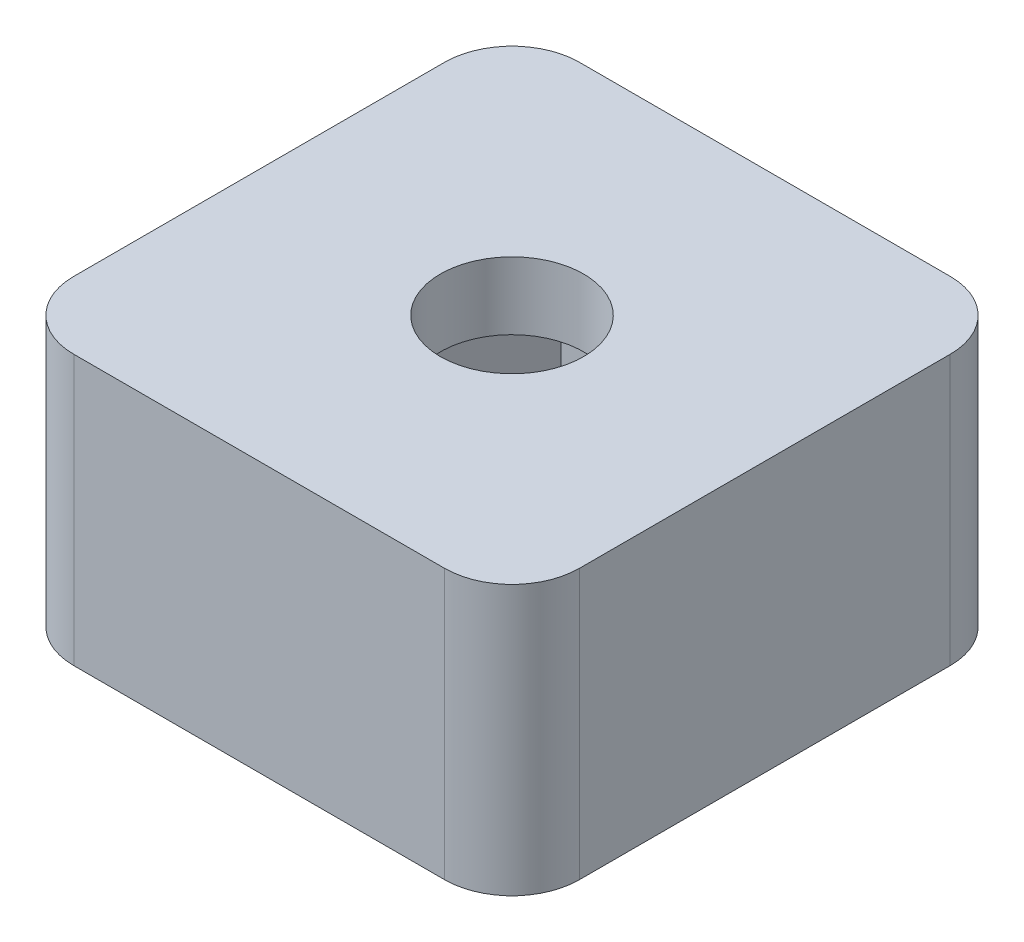
ISO-10303-21;
HEADER;
FILE_DESCRIPTION(('STEP AP214'),'2;1');
FILE_NAME('part.step','',(''),(''),'','','');
FILE_SCHEMA(('AUTOMOTIVE_DESIGN { 1 0 10303 214 1 1 1 1 }'));
ENDSEC;
DATA;
#1=APPLICATION_CONTEXT('core data for automotive mechanical design processes');
#2=APPLICATION_PROTOCOL_DEFINITION('international standard','automotive_design',2000,#1);
#3=PRODUCT_CONTEXT('',#1,'mechanical');
#4=PRODUCT('Part','Part','',(#3));
#5=PRODUCT_RELATED_PRODUCT_CATEGORY('part','',(#4));
#6=PRODUCT_DEFINITION_FORMATION('','',#4);
#7=PRODUCT_DEFINITION_CONTEXT('part definition',#1,'design');
#8=PRODUCT_DEFINITION('design','',#6,#7);
#9=PRODUCT_DEFINITION_SHAPE('','',#8);
#10=(LENGTH_UNIT() NAMED_UNIT(*) SI_UNIT(.MILLI.,.METRE.));
#11=(NAMED_UNIT(*) PLANE_ANGLE_UNIT() SI_UNIT($,.RADIAN.));
#12=(NAMED_UNIT(*) SI_UNIT($,.STERADIAN.) SOLID_ANGLE_UNIT());
#13=UNCERTAINTY_MEASURE_WITH_UNIT(LENGTH_MEASURE(1.E-05),#10,'distance_accuracy_value','');
#14=(GEOMETRIC_REPRESENTATION_CONTEXT(3) GLOBAL_UNCERTAINTY_ASSIGNED_CONTEXT((#13)) GLOBAL_UNIT_ASSIGNED_CONTEXT((#10,
#11,#12)) REPRESENTATION_CONTEXT('',''));
#15=CARTESIAN_POINT('',(0.,0.,0.));
#16=DIRECTION('',(0.,0.,1.));
#17=DIRECTION('',(1.,0.,0.));
#18=AXIS2_PLACEMENT_3D('',#15,#16,#17);
#19=CARTESIAN_POINT('',(0.,0.,0.));
#20=DIRECTION('',(0.,-1.,0.));
#21=DIRECTION('',(0.,0.,-1.));
#22=AXIS2_PLACEMENT_3D('',#19,#20,#21);
#23=PLANE('',#22);
#24=DIRECTION('',(-1.,0.,0.));
#25=VECTOR('',#24,1.);
#26=CARTESIAN_POINT('',(0.,0.,-15.));
#27=LINE('',#26,#25);
#28=CARTESIAN_POINT('',(13.,0.,-15.));
#29=VERTEX_POINT('',#28);
#30=CARTESIAN_POINT('',(2.,0.,-15.));
#31=VERTEX_POINT('',#30);
#32=EDGE_CURVE('E176',#29,#31,#27,.T.);
#33=ORIENTED_EDGE('',*,*,#32,.F.);
#34=CARTESIAN_POINT('',(13.,0.,-13.));
#35=DIRECTION('',(0.,-1.,0.));
#36=DIRECTION('',(0.,0.,-1.));
#37=AXIS2_PLACEMENT_3D('',#34,#35,#36);
#38=CIRCLE('',#37,2.);
#39=CARTESIAN_POINT('',(15.,0.,-13.));
#40=VERTEX_POINT('',#39);
#41=EDGE_CURVE('E204',#29,#40,#38,.T.);
#42=ORIENTED_EDGE('',*,*,#41,.T.);
#43=DIRECTION('',(0.,0.,-1.));
#44=VECTOR('',#43,1.);
#45=CARTESIAN_POINT('',(15.,0.,0.));
#46=LINE('',#45,#44);
#47=CARTESIAN_POINT('',(15.,0.,-2.));
#48=VERTEX_POINT('',#47);
#49=EDGE_CURVE('E189',#48,#40,#46,.T.);
#50=ORIENTED_EDGE('',*,*,#49,.F.);
#51=CARTESIAN_POINT('',(13.,0.,-2.));
#52=DIRECTION('',(0.,-1.,0.));
#53=DIRECTION('',(0.,0.,-1.));
#54=AXIS2_PLACEMENT_3D('',#51,#52,#53);
#55=CIRCLE('',#54,2.);
#56=CARTESIAN_POINT('',(13.,0.,0.));
#57=VERTEX_POINT('',#56);
#58=EDGE_CURVE('E202',#48,#57,#55,.T.);
#59=ORIENTED_EDGE('',*,*,#58,.T.);
#60=DIRECTION('',(1.,0.,0.));
#61=VECTOR('',#60,1.);
#62=CARTESIAN_POINT('',(0.,0.,0.));
#63=LINE('',#62,#61);
#64=CARTESIAN_POINT('',(2.,0.,0.));
#65=VERTEX_POINT('',#64);
#66=EDGE_CURVE('E187',#65,#57,#63,.T.);
#67=ORIENTED_EDGE('',*,*,#66,.F.);
#68=CARTESIAN_POINT('',(2.,0.,-2.));
#69=DIRECTION('',(0.,-1.,0.));
#70=DIRECTION('',(0.,0.,-1.));
#71=AXIS2_PLACEMENT_3D('',#68,#69,#70);
#72=CIRCLE('',#71,2.);
#73=CARTESIAN_POINT('',(0.,0.,-2.));
#74=VERTEX_POINT('',#73);
#75=EDGE_CURVE('E200',#65,#74,#72,.T.);
#76=ORIENTED_EDGE('',*,*,#75,.T.);
#77=DIRECTION('',(0.,0.,1.));
#78=VECTOR('',#77,1.);
#79=CARTESIAN_POINT('',(0.,0.,0.));
#80=LINE('',#79,#78);
#81=CARTESIAN_POINT('',(0.,0.,-13.));
#82=VERTEX_POINT('',#81);
#83=EDGE_CURVE('E172',#82,#74,#80,.T.);
#84=ORIENTED_EDGE('',*,*,#83,.F.);
#85=CARTESIAN_POINT('',(2.,0.,-13.));
#86=DIRECTION('',(0.,-1.,0.));
#87=DIRECTION('',(0.,0.,-1.));
#88=AXIS2_PLACEMENT_3D('',#85,#86,#87);
#89=CIRCLE('',#88,2.);
#90=EDGE_CURVE('E198',#82,#31,#89,.T.);
#91=ORIENTED_EDGE('',*,*,#90,.T.);
#92=EDGE_LOOP('',(#33,#42,#50,#59,#67,#76,#84,#91));
#93=FACE_BOUND('',#92,.T.);
#94=DIRECTION('',(1.,0.,0.));
#95=VECTOR('',#94,1.);
#96=CARTESIAN_POINT('',(5.50814157129579,0.,-4.05));
#97=LINE('',#96,#95);
#98=CARTESIAN_POINT('',(5.50814157129579,0.,-4.05));
#99=VERTEX_POINT('',#98);
#100=CARTESIAN_POINT('',(9.49185842870421,0.,-4.05));
#101=VERTEX_POINT('',#100);
#102=EDGE_CURVE('E155',#99,#101,#97,.T.);
#103=ORIENTED_EDGE('',*,*,#102,.T.);
#104=DIRECTION('',(0.5,0.,-0.866025403784439));
#105=VECTOR('',#104,1.);
#106=CARTESIAN_POINT('',(9.49185842870421,0.,-4.05));
#107=LINE('',#106,#105);
#108=CARTESIAN_POINT('',(11.4837168574084,0.,-7.5));
#109=VERTEX_POINT('',#108);
#110=EDGE_CURVE('E421',#101,#109,#107,.T.);
#111=ORIENTED_EDGE('',*,*,#110,.T.);
#112=DIRECTION('',(-0.5,0.,-0.866025403784439));
#113=VECTOR('',#112,1.);
#114=CARTESIAN_POINT('',(11.4837168574084,0.,-7.5));
#115=LINE('',#114,#113);
#116=CARTESIAN_POINT('',(9.49185842870421,0.,-10.95));
#117=VERTEX_POINT('',#116);
#118=EDGE_CURVE('E159',#109,#117,#115,.T.);
#119=ORIENTED_EDGE('',*,*,#118,.T.);
#120=DIRECTION('',(-1.,0.,0.));
#121=VECTOR('',#120,1.);
#122=CARTESIAN_POINT('',(9.49185842870421,0.,-10.95));
#123=LINE('',#122,#121);
#124=CARTESIAN_POINT('',(5.50814157129579,0.,-10.95));
#125=VERTEX_POINT('',#124);
#126=EDGE_CURVE('E414',#117,#125,#123,.T.);
#127=ORIENTED_EDGE('',*,*,#126,.T.);
#128=DIRECTION('',(-0.5,0.,0.866025403784439));
#129=VECTOR('',#128,1.);
#130=CARTESIAN_POINT('',(5.50814157129579,0.,-10.95));
#131=LINE('',#130,#129);
#132=CARTESIAN_POINT('',(3.51628314259158,0.,-7.5));
#133=VERTEX_POINT('',#132);
#134=EDGE_CURVE('E418',#125,#133,#131,.T.);
#135=ORIENTED_EDGE('',*,*,#134,.T.);
#136=DIRECTION('',(0.5,0.,0.866025403784439));
#137=VECTOR('',#136,1.);
#138=CARTESIAN_POINT('',(3.51628314259158,0.,-7.5));
#139=LINE('',#138,#137);
#140=EDGE_CURVE('E427',#133,#99,#139,.T.);
#141=ORIENTED_EDGE('',*,*,#140,.T.);
#142=EDGE_LOOP('',(#103,#111,#119,#127,#135,#141));
#143=FACE_BOUND('',#142,.T.);
#144=ADVANCED_FACE('F33',(#93,#143),#23,.T.);
#145=CARTESIAN_POINT('',(0.,8.,0.));
#146=DIRECTION('',(1.,0.,0.));
#147=DIRECTION('',(0.,0.,-1.));
#148=AXIS2_PLACEMENT_3D('',#145,#146,#147);
#149=PLANE('',#148);
#150=ORIENTED_EDGE('',*,*,#83,.T.);
#151=DIRECTION('',(0.,-1.,0.));
#152=VECTOR('',#151,1.);
#153=CARTESIAN_POINT('',(0.,8.,-2.));
#154=LINE('',#153,#152);
#155=CARTESIAN_POINT('',(0.,8.,-2.));
#156=VERTEX_POINT('',#155);
#157=EDGE_CURVE('E11',#74,#156,#154,.F.);
#158=ORIENTED_EDGE('',*,*,#157,.T.);
#159=DIRECTION('',(0.,0.,1.));
#160=VECTOR('',#159,1.);
#161=CARTESIAN_POINT('',(0.,8.,0.));
#162=LINE('',#161,#160);
#163=CARTESIAN_POINT('',(0.,8.,-13.));
#164=VERTEX_POINT('',#163);
#165=EDGE_CURVE('E173',#164,#156,#162,.T.);
#166=ORIENTED_EDGE('',*,*,#165,.F.);
#167=DIRECTION('',(0.,-1.,0.));
#168=VECTOR('',#167,1.);
#169=CARTESIAN_POINT('',(0.,8.,-13.));
#170=LINE('',#169,#168);
#171=EDGE_CURVE('E41',#164,#82,#170,.T.);
#172=ORIENTED_EDGE('',*,*,#171,.T.);
#173=EDGE_LOOP('',(#150,#158,#166,#172));
#174=FACE_BOUND('',#173,.T.);
#175=ADVANCED_FACE('F226',(#174),#149,.F.);
#176=CARTESIAN_POINT('',(0.,8.,0.));
#177=DIRECTION('',(0.,0.,-1.));
#178=DIRECTION('',(-1.,0.,0.));
#179=AXIS2_PLACEMENT_3D('',#176,#177,#178);
#180=PLANE('',#179);
#181=ORIENTED_EDGE('',*,*,#66,.T.);
#182=DIRECTION('',(0.,-1.,0.));
#183=VECTOR('',#182,1.);
#184=CARTESIAN_POINT('',(13.,8.,0.));
#185=LINE('',#184,#183);
#186=CARTESIAN_POINT('',(13.,8.,0.));
#187=VERTEX_POINT('',#186);
#188=EDGE_CURVE('E48',#57,#187,#185,.F.);
#189=ORIENTED_EDGE('',*,*,#188,.T.);
#190=DIRECTION('',(1.,0.,0.));
#191=VECTOR('',#190,1.);
#192=CARTESIAN_POINT('',(0.,8.,0.));
#193=LINE('',#192,#191);
#194=CARTESIAN_POINT('',(2.,8.,0.));
#195=VERTEX_POINT('',#194);
#196=EDGE_CURVE('E175',#195,#187,#193,.T.);
#197=ORIENTED_EDGE('',*,*,#196,.F.);
#198=DIRECTION('',(0.,-1.,0.));
#199=VECTOR('',#198,1.);
#200=CARTESIAN_POINT('',(2.,8.,0.));
#201=LINE('',#200,#199);
#202=EDGE_CURVE('E218',#195,#65,#201,.T.);
#203=ORIENTED_EDGE('',*,*,#202,.T.);
#204=EDGE_LOOP('',(#181,#189,#197,#203));
#205=FACE_BOUND('',#204,.T.);
#206=ADVANCED_FACE('F237',(#205),#180,.F.);
#207=CARTESIAN_POINT('',(15.,8.,0.));
#208=DIRECTION('',(-1.,0.,0.));
#209=DIRECTION('',(0.,0.,1.));
#210=AXIS2_PLACEMENT_3D('',#207,#208,#209);
#211=PLANE('',#210);
#212=ORIENTED_EDGE('',*,*,#49,.T.);
#213=DIRECTION('',(0.,-1.,0.));
#214=VECTOR('',#213,1.);
#215=CARTESIAN_POINT('',(15.,8.,-13.));
#216=LINE('',#215,#214);
#217=CARTESIAN_POINT('',(15.,8.,-13.));
#218=VERTEX_POINT('',#217);
#219=EDGE_CURVE('E209',#40,#218,#216,.F.);
#220=ORIENTED_EDGE('',*,*,#219,.T.);
#221=DIRECTION('',(0.,0.,-1.));
#222=VECTOR('',#221,1.);
#223=CARTESIAN_POINT('',(15.,8.,0.));
#224=LINE('',#223,#222);
#225=CARTESIAN_POINT('',(15.,8.,-2.));
#226=VERTEX_POINT('',#225);
#227=EDGE_CURVE('E178',#226,#218,#224,.T.);
#228=ORIENTED_EDGE('',*,*,#227,.F.);
#229=DIRECTION('',(0.,-1.,0.));
#230=VECTOR('',#229,1.);
#231=CARTESIAN_POINT('',(15.,8.,-2.));
#232=LINE('',#231,#230);
#233=EDGE_CURVE('E206',#226,#48,#232,.T.);
#234=ORIENTED_EDGE('',*,*,#233,.T.);
#235=EDGE_LOOP('',(#212,#220,#228,#234));
#236=FACE_BOUND('',#235,.T.);
#237=ADVANCED_FACE('F246',(#236),#211,.F.);
#238=CARTESIAN_POINT('',(0.,8.,-15.));
#239=DIRECTION('',(0.,0.,1.));
#240=DIRECTION('',(1.,0.,0.));
#241=AXIS2_PLACEMENT_3D('',#238,#239,#240);
#242=PLANE('',#241);
#243=DIRECTION('',(-1.,0.,0.));
#244=VECTOR('',#243,1.);
#245=CARTESIAN_POINT('',(0.,8.,-15.));
#246=LINE('',#245,#244);
#247=CARTESIAN_POINT('',(13.,8.,-15.));
#248=VERTEX_POINT('',#247);
#249=CARTESIAN_POINT('',(2.,8.,-15.));
#250=VERTEX_POINT('',#249);
#251=EDGE_CURVE('E181',#248,#250,#246,.T.);
#252=ORIENTED_EDGE('',*,*,#251,.F.);
#253=DIRECTION('',(0.,-1.,0.));
#254=VECTOR('',#253,1.);
#255=CARTESIAN_POINT('',(13.,8.,-15.));
#256=LINE('',#255,#254);
#257=EDGE_CURVE('E195',#248,#29,#256,.T.);
#258=ORIENTED_EDGE('',*,*,#257,.T.);
#259=ORIENTED_EDGE('',*,*,#32,.T.);
#260=DIRECTION('',(0.,-1.,0.));
#261=VECTOR('',#260,1.);
#262=CARTESIAN_POINT('',(2.,8.,-15.));
#263=LINE('',#262,#261);
#264=EDGE_CURVE('E184',#31,#250,#263,.F.);
#265=ORIENTED_EDGE('',*,*,#264,.T.);
#266=EDGE_LOOP('',(#252,#258,#259,#265));
#267=FACE_BOUND('',#266,.T.);
#268=ADVANCED_FACE('F254',(#267),#242,.F.);
#269=CARTESIAN_POINT('',(0.,8.,0.));
#270=DIRECTION('',(0.,-1.,0.));
#271=DIRECTION('',(0.,0.,-1.));
#272=AXIS2_PLACEMENT_3D('',#269,#270,#271);
#273=PLANE('',#272);
#274=CARTESIAN_POINT('',(7.5,8.,-7.5));
#275=DIRECTION('',(0.,1.,0.));
#276=DIRECTION('',(0.,0.,1.));
#277=AXIS2_PLACEMENT_3D('',#274,#275,#276);
#278=CIRCLE('',#277,2.125);
#279=CARTESIAN_POINT('',(7.5,8.,-5.375));
#280=VERTEX_POINT('',#279);
#281=EDGE_CURVE('E164',#280,#280,#278,.T.);
#282=ORIENTED_EDGE('',*,*,#281,.F.);
#283=EDGE_LOOP('',(#282));
#284=FACE_BOUND('',#283,.T.);
#285=ORIENTED_EDGE('',*,*,#227,.T.);
#286=CARTESIAN_POINT('',(13.,8.,-13.));
#287=DIRECTION('',(0.,-1.,0.));
#288=DIRECTION('',(0.,0.,-1.));
#289=AXIS2_PLACEMENT_3D('',#286,#287,#288);
#290=CIRCLE('',#289,2.);
#291=EDGE_CURVE('E216',#218,#248,#290,.F.);
#292=ORIENTED_EDGE('',*,*,#291,.T.);
#293=ORIENTED_EDGE('',*,*,#251,.T.);
#294=CARTESIAN_POINT('',(2.,8.,-13.));
#295=DIRECTION('',(0.,-1.,0.));
#296=DIRECTION('',(0.,0.,-1.));
#297=AXIS2_PLACEMENT_3D('',#294,#295,#296);
#298=CIRCLE('',#297,2.);
#299=EDGE_CURVE('E211',#250,#164,#298,.F.);
#300=ORIENTED_EDGE('',*,*,#299,.T.);
#301=ORIENTED_EDGE('',*,*,#165,.T.);
#302=CARTESIAN_POINT('',(2.,8.,-2.));
#303=DIRECTION('',(0.,-1.,0.));
#304=DIRECTION('',(0.,0.,-1.));
#305=AXIS2_PLACEMENT_3D('',#302,#303,#304);
#306=CIRCLE('',#305,2.);
#307=EDGE_CURVE('E55',#156,#195,#306,.F.);
#308=ORIENTED_EDGE('',*,*,#307,.T.);
#309=ORIENTED_EDGE('',*,*,#196,.T.);
#310=CARTESIAN_POINT('',(13.,8.,-2.));
#311=DIRECTION('',(0.,-1.,0.));
#312=DIRECTION('',(0.,0.,-1.));
#313=AXIS2_PLACEMENT_3D('',#310,#311,#312);
#314=CIRCLE('',#313,2.);
#315=EDGE_CURVE('E214',#187,#226,#314,.F.);
#316=ORIENTED_EDGE('',*,*,#315,.T.);
#317=EDGE_LOOP('',(#285,#292,#293,#300,#301,#308,#309,#316));
#318=FACE_BOUND('',#317,.T.);
#319=ADVANCED_FACE('F239',(#284,#318),#273,.F.);
#320=CARTESIAN_POINT('',(7.5,0.,-7.5));
#321=DIRECTION('',(0.,1.,0.));
#322=DIRECTION('',(0.,0.,1.));
#323=AXIS2_PLACEMENT_3D('',#320,#321,#322);
#324=CYLINDRICAL_SURFACE('',#323,2.125);
#325=CARTESIAN_POINT('',(7.5,6.,-7.5));
#326=DIRECTION('',(0.,1.,0.));
#327=DIRECTION('',(0.,0.,1.));
#328=AXIS2_PLACEMENT_3D('',#325,#326,#327);
#329=CIRCLE('',#328,2.125);
#330=CARTESIAN_POINT('',(7.5,6.,-5.375));
#331=VERTEX_POINT('',#330);
#332=EDGE_CURVE('E160',#331,#331,#329,.F.);
#333=ORIENTED_EDGE('',*,*,#332,.T.);
#334=EDGE_LOOP('',(#333));
#335=FACE_BOUND('',#334,.T.);
#336=ORIENTED_EDGE('',*,*,#281,.T.);
#337=EDGE_LOOP('',(#336));
#338=FACE_BOUND('',#337,.T.);
#339=ADVANCED_FACE('F357',(#335,#338),#324,.F.);
#340=CARTESIAN_POINT('',(0.,6.,0.));
#341=DIRECTION('',(0.,1.,0.));
#342=DIRECTION('',(0.,0.,1.));
#343=AXIS2_PLACEMENT_3D('',#340,#341,#342);
#344=PLANE('',#343);
#345=DIRECTION('',(0.5,0.,-0.866025403784439));
#346=VECTOR('',#345,1.);
#347=CARTESIAN_POINT('',(9.49185842870421,6.,-4.05));
#348=LINE('',#347,#346);
#349=CARTESIAN_POINT('',(9.49185842870421,6.,-4.05));
#350=VERTEX_POINT('',#349);
#351=CARTESIAN_POINT('',(11.4837168574084,6.,-7.5));
#352=VERTEX_POINT('',#351);
#353=EDGE_CURVE('E140',#350,#352,#348,.T.);
#354=ORIENTED_EDGE('',*,*,#353,.F.);
#355=DIRECTION('',(1.,0.,0.));
#356=VECTOR('',#355,1.);
#357=CARTESIAN_POINT('',(5.50814157129579,6.,-4.05));
#358=LINE('',#357,#356);
#359=CARTESIAN_POINT('',(5.50814157129579,6.,-4.05));
#360=VERTEX_POINT('',#359);
#361=EDGE_CURVE('E433',#360,#350,#358,.T.);
#362=ORIENTED_EDGE('',*,*,#361,.F.);
#363=DIRECTION('',(0.5,0.,0.866025403784439));
#364=VECTOR('',#363,1.);
#365=CARTESIAN_POINT('',(3.51628314259158,6.,-7.5));
#366=LINE('',#365,#364);
#367=CARTESIAN_POINT('',(3.51628314259158,6.,-7.5));
#368=VERTEX_POINT('',#367);
#369=EDGE_CURVE('E442',#368,#360,#366,.T.);
#370=ORIENTED_EDGE('',*,*,#369,.F.);
#371=DIRECTION('',(-0.5,0.,0.866025403784439));
#372=VECTOR('',#371,1.);
#373=CARTESIAN_POINT('',(5.50814157129579,6.,-10.95));
#374=LINE('',#373,#372);
#375=CARTESIAN_POINT('',(5.50814157129579,6.,-10.95));
#376=VERTEX_POINT('',#375);
#377=EDGE_CURVE('E438',#376,#368,#374,.T.);
#378=ORIENTED_EDGE('',*,*,#377,.F.);
#379=DIRECTION('',(-1.,0.,0.));
#380=VECTOR('',#379,1.);
#381=CARTESIAN_POINT('',(9.49185842870421,6.,-10.95));
#382=LINE('',#381,#380);
#383=CARTESIAN_POINT('',(9.49185842870421,6.,-10.95));
#384=VERTEX_POINT('',#383);
#385=EDGE_CURVE('E142',#384,#376,#382,.T.);
#386=ORIENTED_EDGE('',*,*,#385,.F.);
#387=DIRECTION('',(-0.5,0.,-0.866025403784439));
#388=VECTOR('',#387,1.);
#389=CARTESIAN_POINT('',(11.4837168574084,6.,-7.5));
#390=LINE('',#389,#388);
#391=EDGE_CURVE('E135',#352,#384,#390,.T.);
#392=ORIENTED_EDGE('',*,*,#391,.F.);
#393=EDGE_LOOP('',(#354,#362,#370,#378,#386,#392));
#394=FACE_BOUND('',#393,.T.);
#395=ORIENTED_EDGE('',*,*,#332,.F.);
#396=EDGE_LOOP('',(#395));
#397=FACE_BOUND('',#396,.T.);
#398=ADVANCED_FACE('F137',(#394,#397),#344,.F.);
#399=CARTESIAN_POINT('',(9.49185842870421,6.,-4.05));
#400=DIRECTION('',(-0.866025403784438,0.,-0.5));
#401=DIRECTION('',(-0.5,0.,0.866025403784439));
#402=AXIS2_PLACEMENT_3D('',#399,#400,#401);
#403=PLANE('',#402);
#404=ORIENTED_EDGE('',*,*,#110,.F.);
#405=DIRECTION('',(0.,-1.,0.));
#406=VECTOR('',#405,1.);
#407=CARTESIAN_POINT('',(9.49185842870421,6.,-4.05));
#408=LINE('',#407,#406);
#409=EDGE_CURVE('E154',#350,#101,#408,.T.);
#410=ORIENTED_EDGE('',*,*,#409,.F.);
#411=ORIENTED_EDGE('',*,*,#353,.T.);
#412=DIRECTION('',(0.,-1.,0.));
#413=VECTOR('',#412,1.);
#414=CARTESIAN_POINT('',(11.4837168574084,6.,-7.5));
#415=LINE('',#414,#413);
#416=EDGE_CURVE('E151',#352,#109,#415,.T.);
#417=ORIENTED_EDGE('',*,*,#416,.T.);
#418=EDGE_LOOP('',(#404,#410,#411,#417));
#419=FACE_BOUND('',#418,.T.);
#420=ADVANCED_FACE('F150',(#419),#403,.T.);
#421=CARTESIAN_POINT('',(11.4837168574084,6.,-7.5));
#422=DIRECTION('',(-0.866025403784439,0.,0.5));
#423=DIRECTION('',(0.5,0.,0.866025403784439));
#424=AXIS2_PLACEMENT_3D('',#421,#422,#423);
#425=PLANE('',#424);
#426=ORIENTED_EDGE('',*,*,#118,.F.);
#427=ORIENTED_EDGE('',*,*,#416,.F.);
#428=ORIENTED_EDGE('',*,*,#391,.T.);
#429=DIRECTION('',(0.,-1.,0.));
#430=VECTOR('',#429,1.);
#431=CARTESIAN_POINT('',(9.49185842870421,6.,-10.95));
#432=LINE('',#431,#430);
#433=EDGE_CURVE('E161',#384,#117,#432,.T.);
#434=ORIENTED_EDGE('',*,*,#433,.T.);
#435=EDGE_LOOP('',(#426,#427,#428,#434));
#436=FACE_BOUND('',#435,.T.);
#437=ADVANCED_FACE('F157',(#436),#425,.T.);
#438=CARTESIAN_POINT('',(9.49185842870421,6.,-10.95));
#439=DIRECTION('',(0.,0.,1.));
#440=DIRECTION('',(1.,0.,0.));
#441=AXIS2_PLACEMENT_3D('',#438,#439,#440);
#442=PLANE('',#441);
#443=ORIENTED_EDGE('',*,*,#126,.F.);
#444=ORIENTED_EDGE('',*,*,#433,.F.);
#445=ORIENTED_EDGE('',*,*,#385,.T.);
#446=DIRECTION('',(0.,-1.,0.));
#447=VECTOR('',#446,1.);
#448=CARTESIAN_POINT('',(5.50814157129579,6.,-10.95));
#449=LINE('',#448,#447);
#450=EDGE_CURVE('E166',#376,#125,#449,.T.);
#451=ORIENTED_EDGE('',*,*,#450,.T.);
#452=EDGE_LOOP('',(#443,#444,#445,#451));
#453=FACE_BOUND('',#452,.T.);
#454=ADVANCED_FACE('F326',(#453),#442,.T.);
#455=CARTESIAN_POINT('',(5.50814157129579,6.,-10.95));
#456=DIRECTION('',(0.866025403784438,0.,0.5));
#457=DIRECTION('',(0.5,0.,-0.866025403784439));
#458=AXIS2_PLACEMENT_3D('',#455,#456,#457);
#459=PLANE('',#458);
#460=ORIENTED_EDGE('',*,*,#134,.F.);
#461=ORIENTED_EDGE('',*,*,#450,.F.);
#462=ORIENTED_EDGE('',*,*,#377,.T.);
#463=DIRECTION('',(0.,-1.,0.));
#464=VECTOR('',#463,1.);
#465=CARTESIAN_POINT('',(3.51628314259158,6.,-7.5));
#466=LINE('',#465,#464);
#467=EDGE_CURVE('E435',#368,#133,#466,.T.);
#468=ORIENTED_EDGE('',*,*,#467,.T.);
#469=EDGE_LOOP('',(#460,#461,#462,#468));
#470=FACE_BOUND('',#469,.T.);
#471=ADVANCED_FACE('F317',(#470),#459,.T.);
#472=CARTESIAN_POINT('',(3.51628314259158,6.,-7.5));
#473=DIRECTION('',(0.866025403784439,0.,-0.5));
#474=DIRECTION('',(-0.5,0.,-0.866025403784439));
#475=AXIS2_PLACEMENT_3D('',#472,#473,#474);
#476=PLANE('',#475);
#477=ORIENTED_EDGE('',*,*,#140,.F.);
#478=ORIENTED_EDGE('',*,*,#467,.F.);
#479=ORIENTED_EDGE('',*,*,#369,.T.);
#480=DIRECTION('',(0.,-1.,0.));
#481=VECTOR('',#480,1.);
#482=CARTESIAN_POINT('',(5.50814157129579,6.,-4.05));
#483=LINE('',#482,#481);
#484=EDGE_CURVE('E432',#360,#99,#483,.T.);
#485=ORIENTED_EDGE('',*,*,#484,.T.);
#486=EDGE_LOOP('',(#477,#478,#479,#485));
#487=FACE_BOUND('',#486,.T.);
#488=ADVANCED_FACE('F308',(#487),#476,.T.);
#489=CARTESIAN_POINT('',(5.50814157129579,6.,-4.05));
#490=DIRECTION('',(0.,0.,-1.));
#491=DIRECTION('',(-1.,0.,0.));
#492=AXIS2_PLACEMENT_3D('',#489,#490,#491);
#493=PLANE('',#492);
#494=ORIENTED_EDGE('',*,*,#102,.F.);
#495=ORIENTED_EDGE('',*,*,#484,.F.);
#496=ORIENTED_EDGE('',*,*,#361,.T.);
#497=ORIENTED_EDGE('',*,*,#409,.T.);
#498=EDGE_LOOP('',(#494,#495,#496,#497));
#499=FACE_BOUND('',#498,.T.);
#500=ADVANCED_FACE('F277',(#499),#493,.T.);
#501=CARTESIAN_POINT('',(13.,8.,-13.));
#502=DIRECTION('',(0.,-1.,0.));
#503=DIRECTION('',(0.,0.,-1.));
#504=AXIS2_PLACEMENT_3D('',#501,#502,#503);
#505=CYLINDRICAL_SURFACE('',#504,2.);
#506=ORIENTED_EDGE('',*,*,#291,.F.);
#507=ORIENTED_EDGE('',*,*,#219,.F.);
#508=ORIENTED_EDGE('',*,*,#41,.F.);
#509=ORIENTED_EDGE('',*,*,#257,.F.);
#510=EDGE_LOOP('',(#506,#507,#508,#509));
#511=FACE_BOUND('',#510,.T.);
#512=ADVANCED_FACE('F251',(#511),#505,.T.);
#513=CARTESIAN_POINT('',(13.,8.,-2.));
#514=DIRECTION('',(0.,-1.,0.));
#515=DIRECTION('',(0.,0.,-1.));
#516=AXIS2_PLACEMENT_3D('',#513,#514,#515);
#517=CYLINDRICAL_SURFACE('',#516,2.);
#518=ORIENTED_EDGE('',*,*,#315,.F.);
#519=ORIENTED_EDGE('',*,*,#188,.F.);
#520=ORIENTED_EDGE('',*,*,#58,.F.);
#521=ORIENTED_EDGE('',*,*,#233,.F.);
#522=EDGE_LOOP('',(#518,#519,#520,#521));
#523=FACE_BOUND('',#522,.T.);
#524=ADVANCED_FACE('F243',(#523),#517,.T.);
#525=CARTESIAN_POINT('',(2.,8.,-2.));
#526=DIRECTION('',(0.,-1.,0.));
#527=DIRECTION('',(0.,0.,-1.));
#528=AXIS2_PLACEMENT_3D('',#525,#526,#527);
#529=CYLINDRICAL_SURFACE('',#528,2.);
#530=ORIENTED_EDGE('',*,*,#307,.F.);
#531=ORIENTED_EDGE('',*,*,#157,.F.);
#532=ORIENTED_EDGE('',*,*,#75,.F.);
#533=ORIENTED_EDGE('',*,*,#202,.F.);
#534=EDGE_LOOP('',(#530,#531,#532,#533));
#535=FACE_BOUND('',#534,.T.);
#536=ADVANCED_FACE('F236',(#535),#529,.T.);
#537=CARTESIAN_POINT('',(2.,8.,-13.));
#538=DIRECTION('',(0.,-1.,0.));
#539=DIRECTION('',(0.,0.,-1.));
#540=AXIS2_PLACEMENT_3D('',#537,#538,#539);
#541=CYLINDRICAL_SURFACE('',#540,2.);
#542=ORIENTED_EDGE('',*,*,#299,.F.);
#543=ORIENTED_EDGE('',*,*,#264,.F.);
#544=ORIENTED_EDGE('',*,*,#90,.F.);
#545=ORIENTED_EDGE('',*,*,#171,.F.);
#546=EDGE_LOOP('',(#542,#543,#544,#545));
#547=FACE_BOUND('',#546,.T.);
#548=ADVANCED_FACE('F35',(#547),#541,.T.);
#549=CLOSED_SHELL('',(#144,#175,#206,#237,#268,#319,#339,#398,#420,#437,#454,#471,#488,#500,
#512,#524,#536,#548));
#550=MANIFOLD_SOLID_BREP('B2',#549);
#551=ADVANCED_BREP_SHAPE_REPRESENTATION('',(#18,#550),#14);
#552=SHAPE_DEFINITION_REPRESENTATION(#9,#551);
ENDSEC;
END-ISO-10303-21;
